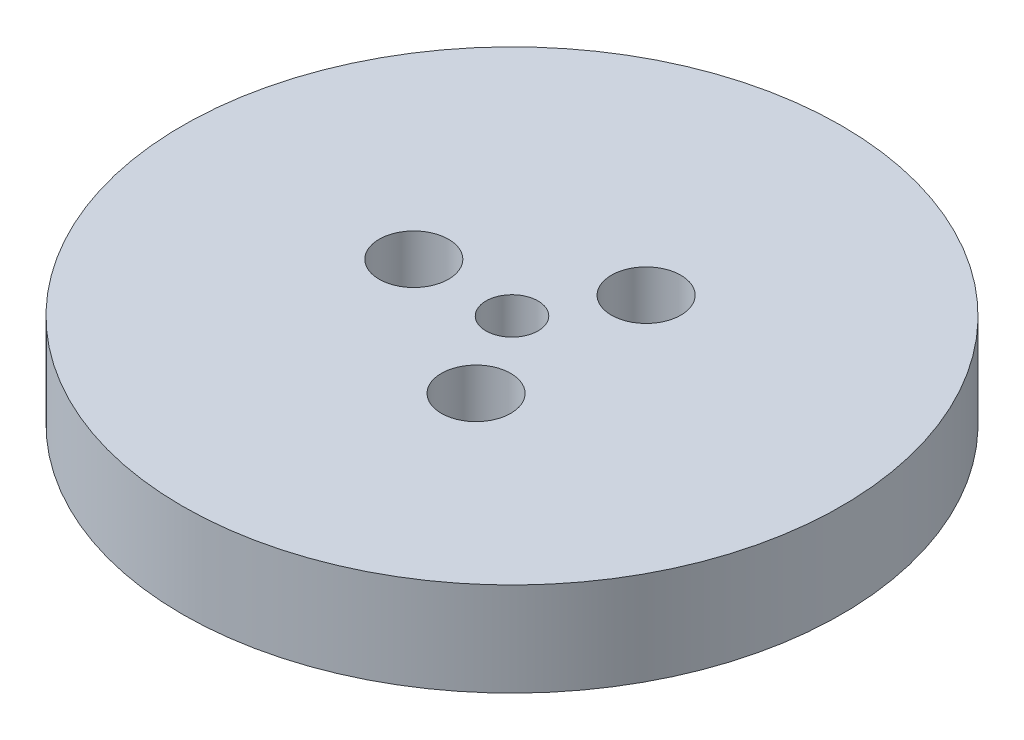
ISO-10303-21;
HEADER;
FILE_DESCRIPTION(('STEP AP214'),'2;1');
FILE_NAME('part.step','',(''),(''),'','','');
FILE_SCHEMA(('AUTOMOTIVE_DESIGN { 1 0 10303 214 1 1 1 1 }'));
ENDSEC;
DATA;
#1=APPLICATION_CONTEXT('core data for automotive mechanical design processes');
#2=APPLICATION_PROTOCOL_DEFINITION('international standard','automotive_design',2000,#1);
#3=PRODUCT_CONTEXT('',#1,'mechanical');
#4=PRODUCT('Part','Part','',(#3));
#5=PRODUCT_RELATED_PRODUCT_CATEGORY('part','',(#4));
#6=PRODUCT_DEFINITION_FORMATION('','',#4);
#7=PRODUCT_DEFINITION_CONTEXT('part definition',#1,'design');
#8=PRODUCT_DEFINITION('design','',#6,#7);
#9=PRODUCT_DEFINITION_SHAPE('','',#8);
#10=(LENGTH_UNIT() NAMED_UNIT(*) SI_UNIT(.MILLI.,.METRE.));
#11=(NAMED_UNIT(*) PLANE_ANGLE_UNIT() SI_UNIT($,.RADIAN.));
#12=(NAMED_UNIT(*) SI_UNIT($,.STERADIAN.) SOLID_ANGLE_UNIT());
#13=UNCERTAINTY_MEASURE_WITH_UNIT(LENGTH_MEASURE(1.E-05),#10,'distance_accuracy_value','');
#14=(GEOMETRIC_REPRESENTATION_CONTEXT(3) GLOBAL_UNCERTAINTY_ASSIGNED_CONTEXT((#13)) GLOBAL_UNIT_ASSIGNED_CONTEXT((#10,
#11,#12)) REPRESENTATION_CONTEXT('',''));
#15=CARTESIAN_POINT('',(0.,0.,0.));
#16=DIRECTION('',(0.,0.,1.));
#17=DIRECTION('',(1.,0.,0.));
#18=AXIS2_PLACEMENT_3D('',#15,#16,#17);
#19=CARTESIAN_POINT('',(0.,27.,0.));
#20=DIRECTION('',(0.,-1.,0.));
#21=DIRECTION('',(0.,0.,-1.));
#22=AXIS2_PLACEMENT_3D('',#19,#20,#21);
#23=CYLINDRICAL_SURFACE('',#22,95.);
#24=CARTESIAN_POINT('',(0.,27.,0.));
#25=DIRECTION('',(0.,1.,0.));
#26=DIRECTION('',(0.,0.,1.));
#27=AXIS2_PLACEMENT_3D('',#24,#25,#26);
#28=CIRCLE('',#27,95.);
#29=CARTESIAN_POINT('',(0.,27.,95.));
#30=VERTEX_POINT('',#29);
#31=EDGE_CURVE('E10',#30,#30,#28,.T.);
#32=ORIENTED_EDGE('',*,*,#31,.F.);
#33=EDGE_LOOP('',(#32));
#34=FACE_BOUND('',#33,.T.);
#35=CARTESIAN_POINT('',(0.,0.,0.));
#36=DIRECTION('',(0.,1.,0.));
#37=DIRECTION('',(0.,0.,1.));
#38=AXIS2_PLACEMENT_3D('',#35,#36,#37);
#39=CIRCLE('',#38,95.);
#40=CARTESIAN_POINT('',(0.,0.,95.));
#41=VERTEX_POINT('',#40);
#42=EDGE_CURVE('E37',#41,#41,#39,.T.);
#43=ORIENTED_EDGE('',*,*,#42,.T.);
#44=EDGE_LOOP('',(#43));
#45=FACE_BOUND('',#44,.T.);
#46=ADVANCED_FACE('F40',(#34,#45),#23,.T.);
#47=CARTESIAN_POINT('',(0.,27.,0.));
#48=DIRECTION('',(0.,1.,0.));
#49=DIRECTION('',(0.,0.,1.));
#50=AXIS2_PLACEMENT_3D('',#47,#48,#49);
#51=PLANE('',#50);
#52=CARTESIAN_POINT('',(14.1499238977139,27.,24.5083871140732));
#53=DIRECTION('',(0.,1.,0.));
#54=DIRECTION('',(0.866025403784436,0.,-0.500000000000004));
#55=AXIS2_PLACEMENT_3D('',#52,#53,#54);
#56=CIRCLE('',#55,10.);
#57=CARTESIAN_POINT('',(22.8101779355582,27.,19.5083871140731));
#58=VERTEX_POINT('',#57);
#59=EDGE_CURVE('E70',#58,#58,#56,.T.);
#60=ORIENTED_EDGE('',*,*,#59,.F.);
#61=EDGE_LOOP('',(#60));
#62=FACE_BOUND('',#61,.T.);
#63=CARTESIAN_POINT('',(14.1499238977135,27.,-24.5083871140734));
#64=DIRECTION('',(0.,1.,0.));
#65=DIRECTION('',(-0.866025403784443,0.,-0.499999999999992));
#66=AXIS2_PLACEMENT_3D('',#63,#64,#65);
#67=CIRCLE('',#66,10.);
#68=CARTESIAN_POINT('',(5.48966985986909,27.,-29.5083871140733));
#69=VERTEX_POINT('',#68);
#70=EDGE_CURVE('E61',#69,#69,#67,.T.);
#71=ORIENTED_EDGE('',*,*,#70,.F.);
#72=EDGE_LOOP('',(#71));
#73=FACE_BOUND('',#72,.T.);
#74=CARTESIAN_POINT('',(-28.2998477954275,27.,0.));
#75=DIRECTION('',(0.,1.,0.));
#76=DIRECTION('',(0.,0.,1.));
#77=AXIS2_PLACEMENT_3D('',#74,#75,#76);
#78=CIRCLE('',#77,10.);
#79=CARTESIAN_POINT('',(-28.2998477954275,27.,10.));
#80=VERTEX_POINT('',#79);
#81=EDGE_CURVE('E54',#80,#80,#78,.T.);
#82=ORIENTED_EDGE('',*,*,#81,.F.);
#83=EDGE_LOOP('',(#82));
#84=FACE_BOUND('',#83,.T.);
#85=CARTESIAN_POINT('',(0.,27.,0.));
#86=DIRECTION('',(0.,1.,0.));
#87=DIRECTION('',(0.,0.,1.));
#88=AXIS2_PLACEMENT_3D('',#85,#86,#87);
#89=CIRCLE('',#88,7.5);
#90=CARTESIAN_POINT('',(0.,27.,7.5));
#91=VERTEX_POINT('',#90);
#92=EDGE_CURVE('E50',#91,#91,#89,.T.);
#93=ORIENTED_EDGE('',*,*,#92,.F.);
#94=EDGE_LOOP('',(#93));
#95=FACE_BOUND('',#94,.T.);
#96=ORIENTED_EDGE('',*,*,#31,.T.);
#97=EDGE_LOOP('',(#96));
#98=FACE_BOUND('',#97,.T.);
#99=ADVANCED_FACE('F85',(#62,#73,#84,#95,#98),#51,.T.);
#100=CARTESIAN_POINT('',(0.,0.,0.));
#101=DIRECTION('',(0.,1.,0.));
#102=DIRECTION('',(0.,0.,1.));
#103=AXIS2_PLACEMENT_3D('',#100,#101,#102);
#104=PLANE('',#103);
#105=CARTESIAN_POINT('',(0.,0.,0.));
#106=DIRECTION('',(0.,1.,0.));
#107=DIRECTION('',(0.,0.,1.));
#108=AXIS2_PLACEMENT_3D('',#105,#106,#107);
#109=CIRCLE('',#108,7.5);
#110=CARTESIAN_POINT('',(0.,0.,7.5));
#111=VERTEX_POINT('',#110);
#112=EDGE_CURVE('E47',#111,#111,#109,.T.);
#113=ORIENTED_EDGE('',*,*,#112,.T.);
#114=EDGE_LOOP('',(#113));
#115=FACE_BOUND('',#114,.T.);
#116=ORIENTED_EDGE('',*,*,#42,.F.);
#117=EDGE_LOOP('',(#116));
#118=FACE_BOUND('',#117,.T.);
#119=ADVANCED_FACE('F84',(#115,#118),#104,.F.);
#120=CARTESIAN_POINT('',(0.,27.,0.));
#121=DIRECTION('',(0.,-1.,0.));
#122=DIRECTION('',(0.,0.,-1.));
#123=AXIS2_PLACEMENT_3D('',#120,#121,#122);
#124=CYLINDRICAL_SURFACE('',#123,7.5);
#125=ORIENTED_EDGE('',*,*,#92,.T.);
#126=EDGE_LOOP('',(#125));
#127=FACE_BOUND('',#126,.T.);
#128=ORIENTED_EDGE('',*,*,#112,.F.);
#129=EDGE_LOOP('',(#128));
#130=FACE_BOUND('',#129,.T.);
#131=ADVANCED_FACE('F91',(#127,#130),#124,.F.);
#132=CARTESIAN_POINT('',(-28.2998477954275,4.85393594575185,0.));
#133=DIRECTION('',(0.,1.,0.));
#134=DIRECTION('',(0.,0.,1.));
#135=AXIS2_PLACEMENT_3D('',#132,#133,#134);
#136=CYLINDRICAL_SURFACE('',#135,10.);
#137=CARTESIAN_POINT('',(-28.2998477954275,4.85393594575185,0.));
#138=DIRECTION('',(0.,1.,0.));
#139=DIRECTION('',(0.,0.,1.));
#140=AXIS2_PLACEMENT_3D('',#137,#138,#139);
#141=CIRCLE('',#140,10.);
#142=CARTESIAN_POINT('',(-28.2998477954275,4.85393594575185,10.));
#143=VERTEX_POINT('',#142);
#144=EDGE_CURVE('E55',#143,#143,#141,.T.);
#145=ORIENTED_EDGE('',*,*,#144,.F.);
#146=EDGE_LOOP('',(#145));
#147=FACE_BOUND('',#146,.T.);
#148=ORIENTED_EDGE('',*,*,#81,.T.);
#149=EDGE_LOOP('',(#148));
#150=FACE_BOUND('',#149,.T.);
#151=ADVANCED_FACE('F96',(#147,#150),#136,.F.);
#152=CARTESIAN_POINT('',(-28.2998477954275,4.85393594575185,0.));
#153=DIRECTION('',(0.,1.,0.));
#154=DIRECTION('',(0.,0.,1.));
#155=AXIS2_PLACEMENT_3D('',#152,#153,#154);
#156=PLANE('',#155);
#157=ORIENTED_EDGE('',*,*,#144,.T.);
#158=EDGE_LOOP('',(#157));
#159=FACE_BOUND('',#158,.T.);
#160=ADVANCED_FACE('F127',(#159),#156,.T.);
#161=CARTESIAN_POINT('',(14.1499238977135,4.85393594575185,-24.5083871140734));
#162=DIRECTION('',(0.,1.,0.));
#163=DIRECTION('',(0.,0.,1.));
#164=AXIS2_PLACEMENT_3D('',#161,#162,#163);
#165=CYLINDRICAL_SURFACE('',#164,10.);
#166=CARTESIAN_POINT('',(14.1499238977135,4.85393594575185,-24.5083871140734));
#167=DIRECTION('',(0.,1.,0.));
#168=DIRECTION('',(-0.866025403784443,0.,-0.499999999999992));
#169=AXIS2_PLACEMENT_3D('',#166,#167,#168);
#170=CIRCLE('',#169,10.);
#171=CARTESIAN_POINT('',(5.48966985986909,4.85393594575185,-29.5083871140733));
#172=VERTEX_POINT('',#171);
#173=EDGE_CURVE('E63',#172,#172,#170,.T.);
#174=ORIENTED_EDGE('',*,*,#173,.F.);
#175=EDGE_LOOP('',(#174));
#176=FACE_BOUND('',#175,.T.);
#177=ORIENTED_EDGE('',*,*,#70,.T.);
#178=EDGE_LOOP('',(#177));
#179=FACE_BOUND('',#178,.T.);
#180=ADVANCED_FACE('F133',(#176,#179),#165,.F.);
#181=CARTESIAN_POINT('',(14.1499238977135,4.85393594575185,-24.5083871140734));
#182=DIRECTION('',(0.,1.,0.));
#183=DIRECTION('',(-0.866025403784443,0.,-0.499999999999992));
#184=AXIS2_PLACEMENT_3D('',#181,#182,#183);
#185=PLANE('',#184);
#186=ORIENTED_EDGE('',*,*,#173,.T.);
#187=EDGE_LOOP('',(#186));
#188=FACE_BOUND('',#187,.T.);
#189=ADVANCED_FACE('F77',(#188),#185,.T.);
#190=CARTESIAN_POINT('',(14.1499238977139,4.85393594575185,24.5083871140732));
#191=DIRECTION('',(0.,1.,0.));
#192=DIRECTION('',(0.,0.,1.));
#193=AXIS2_PLACEMENT_3D('',#190,#191,#192);
#194=CYLINDRICAL_SURFACE('',#193,10.);
#195=CARTESIAN_POINT('',(14.1499238977139,4.85393594575185,24.5083871140732));
#196=DIRECTION('',(0.,1.,0.));
#197=DIRECTION('',(0.866025403784436,0.,-0.500000000000004));
#198=AXIS2_PLACEMENT_3D('',#195,#196,#197);
#199=CIRCLE('',#198,10.);
#200=CARTESIAN_POINT('',(22.8101779355582,4.85393594575185,19.5083871140731));
#201=VERTEX_POINT('',#200);
#202=EDGE_CURVE('E59',#201,#201,#199,.T.);
#203=ORIENTED_EDGE('',*,*,#202,.F.);
#204=EDGE_LOOP('',(#203));
#205=FACE_BOUND('',#204,.T.);
#206=ORIENTED_EDGE('',*,*,#59,.T.);
#207=EDGE_LOOP('',(#206));
#208=FACE_BOUND('',#207,.T.);
#209=ADVANCED_FACE('F73',(#205,#208),#194,.F.);
#210=CARTESIAN_POINT('',(14.1499238977139,4.85393594575185,24.5083871140732));
#211=DIRECTION('',(0.,1.,0.));
#212=DIRECTION('',(0.866025403784436,0.,-0.500000000000004));
#213=AXIS2_PLACEMENT_3D('',#210,#211,#212);
#214=PLANE('',#213);
#215=ORIENTED_EDGE('',*,*,#202,.T.);
#216=EDGE_LOOP('',(#215));
#217=FACE_BOUND('',#216,.T.);
#218=ADVANCED_FACE('F71',(#217),#214,.T.);
#219=CLOSED_SHELL('',(#46,#99,#119,#131,#151,#160,#180,#189,#209,#218));
#220=MANIFOLD_SOLID_BREP('B2',#219);
#221=ADVANCED_BREP_SHAPE_REPRESENTATION('',(#18,#220),#14);
#222=SHAPE_DEFINITION_REPRESENTATION(#9,#221);
ENDSEC;
END-ISO-10303-21;
